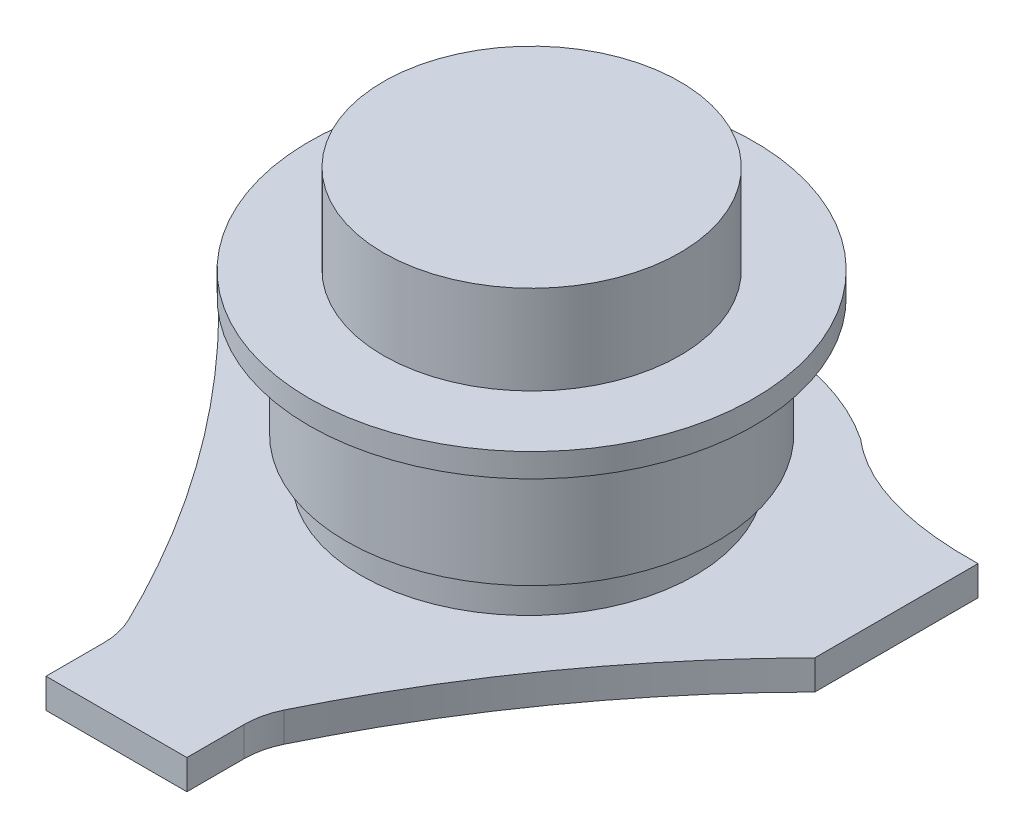
ISO-10303-21;
HEADER;
FILE_DESCRIPTION(('STEP AP214'),'2;1');
FILE_NAME('part.step','',(''),(''),'','','');
FILE_SCHEMA(('AUTOMOTIVE_DESIGN { 1 0 10303 214 1 1 1 1 }'));
ENDSEC;
DATA;
#1=APPLICATION_CONTEXT('core data for automotive mechanical design processes');
#2=APPLICATION_PROTOCOL_DEFINITION('international standard','automotive_design',2000,#1);
#3=PRODUCT_CONTEXT('',#1,'mechanical');
#4=PRODUCT('Part','Part','',(#3));
#5=PRODUCT_RELATED_PRODUCT_CATEGORY('part','',(#4));
#6=PRODUCT_DEFINITION_FORMATION('','',#4);
#7=PRODUCT_DEFINITION_CONTEXT('part definition',#1,'design');
#8=PRODUCT_DEFINITION('design','',#6,#7);
#9=PRODUCT_DEFINITION_SHAPE('','',#8);
#10=(LENGTH_UNIT() NAMED_UNIT(*) SI_UNIT(.MILLI.,.METRE.));
#11=(NAMED_UNIT(*) PLANE_ANGLE_UNIT() SI_UNIT($,.RADIAN.));
#12=(NAMED_UNIT(*) SI_UNIT($,.STERADIAN.) SOLID_ANGLE_UNIT());
#13=UNCERTAINTY_MEASURE_WITH_UNIT(LENGTH_MEASURE(1.E-05),#10,'distance_accuracy_value','');
#14=(GEOMETRIC_REPRESENTATION_CONTEXT(3) GLOBAL_UNCERTAINTY_ASSIGNED_CONTEXT((#13)) GLOBAL_UNIT_ASSIGNED_CONTEXT((#10,
#11,#12)) REPRESENTATION_CONTEXT('',''));
#15=CARTESIAN_POINT('',(0.,0.,0.));
#16=DIRECTION('',(0.,0.,1.));
#17=DIRECTION('',(1.,0.,0.));
#18=AXIS2_PLACEMENT_3D('',#15,#16,#17);
#19=CARTESIAN_POINT('',(-24.765,0.,61.294254306316));
#20=DIRECTION('',(0.,-1.,0.));
#21=DIRECTION('',(0.,0.,-1.));
#22=AXIS2_PLACEMENT_3D('',#19,#20,#21);
#23=CYLINDRICAL_SURFACE('',#22,12.7);
#24=DIRECTION('',(0.,-1.,0.));
#25=VECTOR('',#24,1.);
#26=CARTESIAN_POINT('',(-13.3430442549293,0.,55.7418740097543));
#27=LINE('',#26,#25);
#28=CARTESIAN_POINT('',(-13.3430442549293,0.,55.7418740097543));
#29=VERTEX_POINT('',#28);
#30=CARTESIAN_POINT('',(-13.3430442549293,5.08,55.7418740097543));
#31=VERTEX_POINT('',#30);
#32=EDGE_CURVE('E144',#29,#31,#27,.F.);
#33=ORIENTED_EDGE('',*,*,#32,.F.);
#34=CARTESIAN_POINT('',(-24.765,0.,61.294254306316));
#35=DIRECTION('',(0.,1.,0.));
#36=DIRECTION('',(0.,0.,1.));
#37=AXIS2_PLACEMENT_3D('',#34,#35,#36);
#38=CIRCLE('',#37,12.7);
#39=CARTESIAN_POINT('',(-12.065,0.,61.294254306316));
#40=VERTEX_POINT('',#39);
#41=EDGE_CURVE('E155',#29,#40,#38,.F.);
#42=ORIENTED_EDGE('',*,*,#41,.T.);
#43=DIRECTION('',(0.,1.,0.));
#44=VECTOR('',#43,1.);
#45=CARTESIAN_POINT('',(-12.065,0.,61.294254306316));
#46=LINE('',#45,#44);
#47=CARTESIAN_POINT('',(-12.065,5.08,61.294254306316));
#48=VERTEX_POINT('',#47);
#49=EDGE_CURVE('E147',#48,#40,#46,.F.);
#50=ORIENTED_EDGE('',*,*,#49,.F.);
#51=CARTESIAN_POINT('',(-24.765,5.08,61.294254306316));
#52=DIRECTION('',(0.,1.,0.));
#53=DIRECTION('',(0.,0.,1.));
#54=AXIS2_PLACEMENT_3D('',#51,#52,#53);
#55=CIRCLE('',#54,12.7);
#56=EDGE_CURVE('E157',#48,#31,#55,.T.);
#57=ORIENTED_EDGE('',*,*,#56,.T.);
#58=EDGE_LOOP('',(#33,#42,#50,#57));
#59=FACE_BOUND('',#58,.T.);
#60=ADVANCED_FACE('F33',(#59),#23,.F.);
#61=CARTESIAN_POINT('',(51.054,5.08,0.));
#62=DIRECTION('',(-1.,0.,0.));
#63=DIRECTION('',(0.,0.,1.));
#64=AXIS2_PLACEMENT_3D('',#61,#62,#63);
#65=PLANE('',#64);
#66=DIRECTION('',(0.,0.,-1.));
#67=VECTOR('',#66,1.);
#68=CARTESIAN_POINT('',(51.054,0.,0.));
#69=LINE('',#68,#67);
#70=CARTESIAN_POINT('',(51.054,0.,2.54));
#71=VERTEX_POINT('',#70);
#72=CARTESIAN_POINT('',(51.054,0.,-25.4));
#73=VERTEX_POINT('',#72);
#74=EDGE_CURVE('E143',#71,#73,#69,.T.);
#75=ORIENTED_EDGE('',*,*,#74,.T.);
#76=DIRECTION('',(0.,-1.,0.));
#77=VECTOR('',#76,1.);
#78=CARTESIAN_POINT('',(51.054,5.08,-25.4));
#79=LINE('',#78,#77);
#80=CARTESIAN_POINT('',(51.054,5.08,-25.4));
#81=VERTEX_POINT('',#80);
#82=EDGE_CURVE('E124',#81,#73,#79,.T.);
#83=ORIENTED_EDGE('',*,*,#82,.F.);
#84=DIRECTION('',(0.,0.,-1.));
#85=VECTOR('',#84,1.);
#86=CARTESIAN_POINT('',(51.054,5.08,0.));
#87=LINE('',#86,#85);
#88=CARTESIAN_POINT('',(51.054,5.08,2.54));
#89=VERTEX_POINT('',#88);
#90=EDGE_CURVE('E131',#89,#81,#87,.T.);
#91=ORIENTED_EDGE('',*,*,#90,.F.);
#92=DIRECTION('',(0.,-1.,0.));
#93=VECTOR('',#92,1.);
#94=CARTESIAN_POINT('',(51.054,5.08,2.54));
#95=LINE('',#94,#93);
#96=EDGE_CURVE('E177',#89,#71,#95,.T.);
#97=ORIENTED_EDGE('',*,*,#96,.T.);
#98=EDGE_LOOP('',(#75,#83,#91,#97));
#99=FACE_BOUND('',#98,.T.);
#100=ADVANCED_FACE('F141',(#99),#65,.F.);
#101=CARTESIAN_POINT('',(51.054,5.08,-25.4));
#102=CARTESIAN_POINT('',(32.8121018484096,5.08,-25.0303382975073));
#103=CARTESIAN_POINT('',(22.5628296294602,5.08,-33.8013064704895));
#104=B_SPLINE_CURVE_WITH_KNOTS('',2,(#101,#102,#103),.UNSPECIFIED.,.F.,.F.,(3,3),(0.,
0.488428602010986),.UNSPECIFIED.);
#105=DIRECTION('',(0.,-1.,0.));
#106=VECTOR('',#105,1.);
#107=SURFACE_OF_LINEAR_EXTRUSION('',#104,#106);
#108=CARTESIAN_POINT('',(51.054,0.,-25.4));
#109=CARTESIAN_POINT('',(32.8121018484096,0.,-25.0303382975073));
#110=CARTESIAN_POINT('',(22.5628296294602,0.,-33.8013064704895));
#111=B_SPLINE_CURVE_WITH_KNOTS('',2,(#108,#109,#110),.UNSPECIFIED.,.F.,.F.,(3,3),(0.,
0.488428602010986),.UNSPECIFIED.);
#112=CARTESIAN_POINT('',(22.5628296294601,0.,-33.8013064704895));
#113=VERTEX_POINT('',#112);
#114=EDGE_CURVE('E206',#73,#113,#111,.T.);
#115=ORIENTED_EDGE('',*,*,#114,.T.);
#116=DIRECTION('',(0.,-1.,0.));
#117=VECTOR('',#116,1.);
#118=CARTESIAN_POINT('',(22.5628296294601,5.08,-33.8013064704895));
#119=LINE('',#118,#117);
#120=CARTESIAN_POINT('',(22.5628296294601,5.08,-33.8013064704895));
#121=VERTEX_POINT('',#120);
#122=EDGE_CURVE('E127',#121,#113,#119,.T.);
#123=ORIENTED_EDGE('',*,*,#122,.F.);
#124=EDGE_CURVE('E120',#81,#121,#104,.T.);
#125=ORIENTED_EDGE('',*,*,#124,.F.);
#126=ORIENTED_EDGE('',*,*,#82,.T.);
#127=EDGE_LOOP('',(#115,#123,#125,#126));
#128=FACE_BOUND('',#127,.T.);
#129=ADVANCED_FACE('F122',(#128),#107,.F.);
#130=CARTESIAN_POINT('',(0.,5.08,0.));
#131=DIRECTION('',(0.,-1.,0.));
#132=DIRECTION('',(0.,0.,-1.));
#133=AXIS2_PLACEMENT_3D('',#130,#131,#132);
#134=CYLINDRICAL_SURFACE('',#133,40.64);
#135=CARTESIAN_POINT('',(0.,0.,0.));
#136=DIRECTION('',(0.,1.,0.));
#137=DIRECTION('',(0.,0.,1.));
#138=AXIS2_PLACEMENT_3D('',#135,#136,#137);
#139=CIRCLE('',#138,40.64);
#140=CARTESIAN_POINT('',(-22.5628296294601,0.,-33.8013064704895));
#141=VERTEX_POINT('',#140);
#142=EDGE_CURVE('E204',#113,#141,#139,.T.);
#143=ORIENTED_EDGE('',*,*,#142,.T.);
#144=DIRECTION('',(0.,-1.,0.));
#145=VECTOR('',#144,1.);
#146=CARTESIAN_POINT('',(-22.5628296294601,5.08,-33.8013064704895));
#147=LINE('',#146,#145);
#148=CARTESIAN_POINT('',(-22.5628296294601,5.08,-33.8013064704895));
#149=VERTEX_POINT('',#148);
#150=EDGE_CURVE('E149',#149,#141,#147,.T.);
#151=ORIENTED_EDGE('',*,*,#150,.F.);
#152=CARTESIAN_POINT('',(0.,5.08,0.));
#153=DIRECTION('',(0.,1.,0.));
#154=DIRECTION('',(0.,0.,1.));
#155=AXIS2_PLACEMENT_3D('',#152,#153,#154);
#156=CIRCLE('',#155,40.64);
#157=EDGE_CURVE('E130',#121,#149,#156,.T.);
#158=ORIENTED_EDGE('',*,*,#157,.F.);
#159=ORIENTED_EDGE('',*,*,#122,.T.);
#160=EDGE_LOOP('',(#143,#151,#158,#159));
#161=FACE_BOUND('',#160,.T.);
#162=ADVANCED_FACE('F205',(#161),#134,.T.);
#163=CARTESIAN_POINT('',(-51.054,5.08,-25.4));
#164=CARTESIAN_POINT('',(-32.8121018484096,5.08,-25.0303382975072));
#165=CARTESIAN_POINT('',(-22.5628296294602,5.08,-33.8013064704895));
#166=B_SPLINE_CURVE_WITH_KNOTS('',2,(#163,#164,#165),.UNSPECIFIED.,.F.,.F.,(3,3),(0.,
0.488428602010987),.UNSPECIFIED.);
#167=DIRECTION('',(0.,-1.,0.));
#168=VECTOR('',#167,1.);
#169=SURFACE_OF_LINEAR_EXTRUSION('',#166,#168);
#170=CARTESIAN_POINT('',(-51.054,0.,-25.4));
#171=CARTESIAN_POINT('',(-32.8121018484096,0.,-25.0303382975072));
#172=CARTESIAN_POINT('',(-22.5628296294602,0.,-33.8013064704895));
#173=B_SPLINE_CURVE_WITH_KNOTS('',2,(#170,#171,#172),.UNSPECIFIED.,.F.,.F.,(3,3),(0.,
0.488428602010987),.UNSPECIFIED.);
#174=CARTESIAN_POINT('',(-51.054,0.,-25.4));
#175=VERTEX_POINT('',#174);
#176=EDGE_CURVE('E198',#175,#141,#173,.T.);
#177=ORIENTED_EDGE('',*,*,#176,.F.);
#178=DIRECTION('',(0.,-1.,0.));
#179=VECTOR('',#178,1.);
#180=CARTESIAN_POINT('',(-51.054,5.08,-25.4));
#181=LINE('',#180,#179);
#182=CARTESIAN_POINT('',(-51.054,5.08,-25.4));
#183=VERTEX_POINT('',#182);
#184=EDGE_CURVE('E190',#183,#175,#181,.T.);
#185=ORIENTED_EDGE('',*,*,#184,.F.);
#186=EDGE_CURVE('E201',#183,#149,#166,.T.);
#187=ORIENTED_EDGE('',*,*,#186,.T.);
#188=ORIENTED_EDGE('',*,*,#150,.T.);
#189=EDGE_LOOP('',(#177,#185,#187,#188));
#190=FACE_BOUND('',#189,.T.);
#191=ADVANCED_FACE('F196',(#190),#169,.T.);
#192=CARTESIAN_POINT('',(-51.054,5.08,0.));
#193=DIRECTION('',(-1.,0.,0.));
#194=DIRECTION('',(0.,0.,1.));
#195=AXIS2_PLACEMENT_3D('',#192,#193,#194);
#196=PLANE('',#195);
#197=DIRECTION('',(0.,0.,-1.));
#198=VECTOR('',#197,1.);
#199=CARTESIAN_POINT('',(-51.054,0.,0.));
#200=LINE('',#199,#198);
#201=CARTESIAN_POINT('',(-51.054,0.,2.54));
#202=VERTEX_POINT('',#201);
#203=EDGE_CURVE('E210',#202,#175,#200,.T.);
#204=ORIENTED_EDGE('',*,*,#203,.F.);
#205=DIRECTION('',(0.,-1.,0.));
#206=VECTOR('',#205,1.);
#207=CARTESIAN_POINT('',(-51.054,5.08,2.54));
#208=LINE('',#207,#206);
#209=CARTESIAN_POINT('',(-51.054,5.08,2.54));
#210=VERTEX_POINT('',#209);
#211=EDGE_CURVE('E188',#210,#202,#208,.T.);
#212=ORIENTED_EDGE('',*,*,#211,.F.);
#213=DIRECTION('',(0.,0.,-1.));
#214=VECTOR('',#213,1.);
#215=CARTESIAN_POINT('',(-51.054,5.08,0.));
#216=LINE('',#215,#214);
#217=EDGE_CURVE('E252',#210,#183,#216,.T.);
#218=ORIENTED_EDGE('',*,*,#217,.T.);
#219=ORIENTED_EDGE('',*,*,#184,.T.);
#220=EDGE_LOOP('',(#204,#212,#218,#219));
#221=FACE_BOUND('',#220,.T.);
#222=ADVANCED_FACE('F248',(#221),#196,.T.);
#223=CARTESIAN_POINT('',(-51.054,5.08,2.54000000000001));
#224=CARTESIAN_POINT('',(-26.7459712344895,5.08,27.0771938263688));
#225=CARTESIAN_POINT('',(-12.065,5.08,58.42));
#226=B_SPLINE_CURVE_WITH_KNOTS('',2,(#223,#224,#225),.UNSPECIFIED.,.F.,.F.,(3,3),(0.,1.),.UNSPECIFIED.);
#227=DIRECTION('',(0.,-1.,0.));
#228=VECTOR('',#227,1.);
#229=SURFACE_OF_LINEAR_EXTRUSION('',#226,#228);
#230=CARTESIAN_POINT('',(-51.054,0.,2.54000000000001));
#231=CARTESIAN_POINT('',(-26.7459712344895,0.,27.0771938263688));
#232=CARTESIAN_POINT('',(-12.065,0.,58.42));
#233=B_SPLINE_CURVE_WITH_KNOTS('',2,(#230,#231,#232),.UNSPECIFIED.,.F.,.F.,(3,3),(0.,1.),.UNSPECIFIED.);
#234=EDGE_CURVE('E212',#202,#29,#233,.T.);
#235=ORIENTED_EDGE('',*,*,#234,.T.);
#236=ORIENTED_EDGE('',*,*,#32,.T.);
#237=EDGE_CURVE('E255',#210,#31,#226,.T.);
#238=ORIENTED_EDGE('',*,*,#237,.F.);
#239=ORIENTED_EDGE('',*,*,#211,.T.);
#240=EDGE_LOOP('',(#235,#236,#238,#239));
#241=FACE_BOUND('',#240,.T.);
#242=ADVANCED_FACE('F357',(#241),#229,.F.);
#243=CARTESIAN_POINT('',(-12.065,5.08,0.));
#244=DIRECTION('',(1.,0.,0.));
#245=DIRECTION('',(0.,0.,-1.));
#246=AXIS2_PLACEMENT_3D('',#243,#244,#245);
#247=PLANE('',#246);
#248=DIRECTION('',(0.,0.,1.));
#249=VECTOR('',#248,1.);
#250=CARTESIAN_POINT('',(-12.065,5.08,0.));
#251=LINE('',#250,#249);
#252=CARTESIAN_POINT('',(-12.065,5.08,71.12));
#253=VERTEX_POINT('',#252);
#254=EDGE_CURVE('E242',#48,#253,#251,.T.);
#255=ORIENTED_EDGE('',*,*,#254,.F.);
#256=ORIENTED_EDGE('',*,*,#49,.T.);
#257=DIRECTION('',(0.,0.,1.));
#258=VECTOR('',#257,1.);
#259=CARTESIAN_POINT('',(-12.065,0.,0.));
#260=LINE('',#259,#258);
#261=CARTESIAN_POINT('',(-12.065,0.,71.12));
#262=VERTEX_POINT('',#261);
#263=EDGE_CURVE('E225',#40,#262,#260,.T.);
#264=ORIENTED_EDGE('',*,*,#263,.T.);
#265=DIRECTION('',(0.,-1.,0.));
#266=VECTOR('',#265,1.);
#267=CARTESIAN_POINT('',(-12.065,5.08,71.12));
#268=LINE('',#267,#266);
#269=EDGE_CURVE('E185',#253,#262,#268,.T.);
#270=ORIENTED_EDGE('',*,*,#269,.F.);
#271=EDGE_LOOP('',(#255,#256,#264,#270));
#272=FACE_BOUND('',#271,.T.);
#273=ADVANCED_FACE('F241',(#272),#247,.F.);
#274=CARTESIAN_POINT('',(0.,5.08,71.12));
#275=DIRECTION('',(0.,0.,1.));
#276=DIRECTION('',(1.,0.,0.));
#277=AXIS2_PLACEMENT_3D('',#274,#275,#276);
#278=PLANE('',#277);
#279=DIRECTION('',(-1.,0.,0.));
#280=VECTOR('',#279,1.);
#281=CARTESIAN_POINT('',(0.,0.,71.12));
#282=LINE('',#281,#280);
#283=CARTESIAN_POINT('',(12.065,0.,71.12));
#284=VERTEX_POINT('',#283);
#285=EDGE_CURVE('E171',#284,#262,#282,.T.);
#286=ORIENTED_EDGE('',*,*,#285,.F.);
#287=DIRECTION('',(0.,-1.,0.));
#288=VECTOR('',#287,1.);
#289=CARTESIAN_POINT('',(12.065,5.08,71.12));
#290=LINE('',#289,#288);
#291=CARTESIAN_POINT('',(12.065,5.08,71.12));
#292=VERTEX_POINT('',#291);
#293=EDGE_CURVE('E182',#292,#284,#290,.T.);
#294=ORIENTED_EDGE('',*,*,#293,.F.);
#295=DIRECTION('',(-1.,0.,0.));
#296=VECTOR('',#295,1.);
#297=CARTESIAN_POINT('',(0.,5.08,71.12));
#298=LINE('',#297,#296);
#299=EDGE_CURVE('E238',#292,#253,#298,.T.);
#300=ORIENTED_EDGE('',*,*,#299,.T.);
#301=ORIENTED_EDGE('',*,*,#269,.T.);
#302=EDGE_LOOP('',(#286,#294,#300,#301));
#303=FACE_BOUND('',#302,.T.);
#304=ADVANCED_FACE('F234',(#303),#278,.T.);
#305=CARTESIAN_POINT('',(12.065,5.08,0.));
#306=DIRECTION('',(1.,0.,0.));
#307=DIRECTION('',(0.,0.,-1.));
#308=AXIS2_PLACEMENT_3D('',#305,#306,#307);
#309=PLANE('',#308);
#310=DIRECTION('',(0.,0.,1.));
#311=VECTOR('',#310,1.);
#312=CARTESIAN_POINT('',(12.065,0.,0.));
#313=LINE('',#312,#311);
#314=CARTESIAN_POINT('',(12.065,0.,61.294254306316));
#315=VERTEX_POINT('',#314);
#316=EDGE_CURVE('E169',#315,#284,#313,.T.);
#317=ORIENTED_EDGE('',*,*,#316,.F.);
#318=DIRECTION('',(0.,1.,0.));
#319=VECTOR('',#318,1.);
#320=CARTESIAN_POINT('',(12.065,5.08,61.294254306316));
#321=LINE('',#320,#319);
#322=CARTESIAN_POINT('',(12.065,5.08,61.294254306316));
#323=VERTEX_POINT('',#322);
#324=EDGE_CURVE('E48',#315,#323,#321,.T.);
#325=ORIENTED_EDGE('',*,*,#324,.T.);
#326=DIRECTION('',(0.,0.,1.));
#327=VECTOR('',#326,1.);
#328=CARTESIAN_POINT('',(12.065,5.08,0.));
#329=LINE('',#328,#327);
#330=EDGE_CURVE('E483',#323,#292,#329,.T.);
#331=ORIENTED_EDGE('',*,*,#330,.T.);
#332=ORIENTED_EDGE('',*,*,#293,.T.);
#333=EDGE_LOOP('',(#317,#325,#331,#332));
#334=FACE_BOUND('',#333,.T.);
#335=ADVANCED_FACE('F375',(#334),#309,.T.);
#336=CARTESIAN_POINT('',(51.054,5.08,2.53999999999999));
#337=CARTESIAN_POINT('',(26.7459712344895,5.08,27.0771938263687));
#338=CARTESIAN_POINT('',(12.065,5.08,58.42));
#339=B_SPLINE_CURVE_WITH_KNOTS('',2,(#336,#337,#338),.UNSPECIFIED.,.F.,.F.,(3,3),(0.,1.),.UNSPECIFIED.);
#340=DIRECTION('',(0.,-1.,0.));
#341=VECTOR('',#340,1.);
#342=SURFACE_OF_LINEAR_EXTRUSION('',#339,#341);
#343=CARTESIAN_POINT('',(13.3430442549293,5.08,55.7418740097543));
#344=VERTEX_POINT('',#343);
#345=EDGE_CURVE('E137',#89,#344,#339,.T.);
#346=ORIENTED_EDGE('',*,*,#345,.T.);
#347=DIRECTION('',(0.,-1.,0.));
#348=VECTOR('',#347,1.);
#349=CARTESIAN_POINT('',(13.3430442549293,5.08,55.7418740097543));
#350=LINE('',#349,#348);
#351=CARTESIAN_POINT('',(13.3430442549293,0.,55.7418740097543));
#352=VERTEX_POINT('',#351);
#353=EDGE_CURVE('E159',#344,#352,#350,.T.);
#354=ORIENTED_EDGE('',*,*,#353,.T.);
#355=CARTESIAN_POINT('',(51.054,0.,2.53999999999999));
#356=CARTESIAN_POINT('',(26.7459712344895,0.,27.0771938263687));
#357=CARTESIAN_POINT('',(12.065,0.,58.42));
#358=B_SPLINE_CURVE_WITH_KNOTS('',2,(#355,#356,#357),.UNSPECIFIED.,.F.,.F.,(3,3),(0.,1.),.UNSPECIFIED.);
#359=EDGE_CURVE('E139',#71,#352,#358,.T.);
#360=ORIENTED_EDGE('',*,*,#359,.F.);
#361=ORIENTED_EDGE('',*,*,#96,.F.);
#362=EDGE_LOOP('',(#346,#354,#360,#361));
#363=FACE_BOUND('',#362,.T.);
#364=ADVANCED_FACE('F165',(#363),#342,.T.);
#365=CARTESIAN_POINT('',(0.,5.08,0.));
#366=DIRECTION('',(0.,1.,0.));
#367=DIRECTION('',(0.,0.,1.));
#368=AXIS2_PLACEMENT_3D('',#365,#366,#367);
#369=PLANE('',#368);
#370=CARTESIAN_POINT('',(0.,5.08,0.635000000000045));
#371=DIRECTION('',(0.,1.,0.));
#372=DIRECTION('',(0.,0.,1.));
#373=AXIS2_PLACEMENT_3D('',#370,#371,#372);
#374=CIRCLE('',#373,28.575);
#375=CARTESIAN_POINT('',(0.,5.08,29.2100000000001));
#376=VERTEX_POINT('',#375);
#377=EDGE_CURVE('E281',#376,#376,#374,.T.);
#378=ORIENTED_EDGE('',*,*,#377,.F.);
#379=EDGE_LOOP('',(#378));
#380=FACE_BOUND('',#379,.T.);
#381=ORIENTED_EDGE('',*,*,#56,.F.);
#382=ORIENTED_EDGE('',*,*,#254,.T.);
#383=ORIENTED_EDGE('',*,*,#299,.F.);
#384=ORIENTED_EDGE('',*,*,#330,.F.);
#385=CARTESIAN_POINT('',(24.765,5.08,61.294254306316));
#386=DIRECTION('',(0.,1.,0.));
#387=DIRECTION('',(0.,0.,1.));
#388=AXIS2_PLACEMENT_3D('',#385,#386,#387);
#389=CIRCLE('',#388,12.7);
#390=EDGE_CURVE('E11',#323,#344,#389,.F.);
#391=ORIENTED_EDGE('',*,*,#390,.T.);
#392=ORIENTED_EDGE('',*,*,#345,.F.);
#393=ORIENTED_EDGE('',*,*,#90,.T.);
#394=ORIENTED_EDGE('',*,*,#124,.T.);
#395=ORIENTED_EDGE('',*,*,#157,.T.);
#396=ORIENTED_EDGE('',*,*,#186,.F.);
#397=ORIENTED_EDGE('',*,*,#217,.F.);
#398=ORIENTED_EDGE('',*,*,#237,.T.);
#399=EDGE_LOOP('',(#381,#382,#383,#384,#391,#392,#393,#394,#395,#396,#397,#398));
#400=FACE_BOUND('',#399,.T.);
#401=ADVANCED_FACE('F135',(#380,#400),#369,.T.);
#402=CARTESIAN_POINT('',(0.,0.,0.));
#403=DIRECTION('',(0.,1.,0.));
#404=DIRECTION('',(0.,0.,1.));
#405=AXIS2_PLACEMENT_3D('',#402,#403,#404);
#406=PLANE('',#405);
#407=ORIENTED_EDGE('',*,*,#74,.F.);
#408=ORIENTED_EDGE('',*,*,#359,.T.);
#409=CARTESIAN_POINT('',(24.765,0.,61.294254306316));
#410=DIRECTION('',(0.,1.,0.));
#411=DIRECTION('',(0.,0.,1.));
#412=AXIS2_PLACEMENT_3D('',#409,#410,#411);
#413=CIRCLE('',#412,12.7);
#414=EDGE_CURVE('E41',#352,#315,#413,.T.);
#415=ORIENTED_EDGE('',*,*,#414,.T.);
#416=ORIENTED_EDGE('',*,*,#316,.T.);
#417=ORIENTED_EDGE('',*,*,#285,.T.);
#418=ORIENTED_EDGE('',*,*,#263,.F.);
#419=ORIENTED_EDGE('',*,*,#41,.F.);
#420=ORIENTED_EDGE('',*,*,#234,.F.);
#421=ORIENTED_EDGE('',*,*,#203,.T.);
#422=ORIENTED_EDGE('',*,*,#176,.T.);
#423=ORIENTED_EDGE('',*,*,#142,.F.);
#424=ORIENTED_EDGE('',*,*,#114,.F.);
#425=EDGE_LOOP('',(#407,#408,#415,#416,#417,#418,#419,#420,#421,#422,#423,#424));
#426=FACE_BOUND('',#425,.T.);
#427=ADVANCED_FACE('F168',(#426),#406,.F.);
#428=CARTESIAN_POINT('',(24.765,2.54,61.294254306316));
#429=DIRECTION('',(0.,-1.,0.));
#430=DIRECTION('',(0.,0.,-1.));
#431=AXIS2_PLACEMENT_3D('',#428,#429,#430);
#432=CYLINDRICAL_SURFACE('',#431,12.7);
#433=ORIENTED_EDGE('',*,*,#390,.F.);
#434=ORIENTED_EDGE('',*,*,#324,.F.);
#435=ORIENTED_EDGE('',*,*,#414,.F.);
#436=ORIENTED_EDGE('',*,*,#353,.F.);
#437=EDGE_LOOP('',(#433,#434,#435,#436));
#438=FACE_BOUND('',#437,.T.);
#439=ADVANCED_FACE('F35',(#438),#432,.F.);
#440=CARTESIAN_POINT('',(0.,11.43,0.635000000000045));
#441=DIRECTION('',(0.,-1.,0.));
#442=DIRECTION('',(0.,0.,-1.));
#443=AXIS2_PLACEMENT_3D('',#440,#441,#442);
#444=CYLINDRICAL_SURFACE('',#443,28.575);
#445=CARTESIAN_POINT('',(0.,11.43,0.635000000000045));
#446=DIRECTION('',(0.,1.,0.));
#447=DIRECTION('',(0.,0.,1.));
#448=AXIS2_PLACEMENT_3D('',#445,#446,#447);
#449=CIRCLE('',#448,28.575);
#450=CARTESIAN_POINT('',(0.,11.43,29.2100000000001));
#451=VERTEX_POINT('',#450);
#452=EDGE_CURVE('E284',#451,#451,#449,.T.);
#453=ORIENTED_EDGE('',*,*,#452,.F.);
#454=EDGE_LOOP('',(#453));
#455=FACE_BOUND('',#454,.T.);
#456=ORIENTED_EDGE('',*,*,#377,.T.);
#457=EDGE_LOOP('',(#456));
#458=FACE_BOUND('',#457,.T.);
#459=ADVANCED_FACE('F409',(#455,#458),#444,.T.);
#460=CARTESIAN_POINT('',(0.,31.75,0.));
#461=DIRECTION('',(0.,-1.,0.));
#462=DIRECTION('',(0.,0.,-1.));
#463=AXIS2_PLACEMENT_3D('',#460,#461,#462);
#464=CYLINDRICAL_SURFACE('',#463,31.75);
#465=CARTESIAN_POINT('',(0.,31.75,0.));
#466=DIRECTION('',(0.,1.,0.));
#467=DIRECTION('',(0.,0.,1.));
#468=AXIS2_PLACEMENT_3D('',#465,#466,#467);
#469=CIRCLE('',#468,31.75);
#470=CARTESIAN_POINT('',(0.,31.75,31.75));
#471=VERTEX_POINT('',#470);
#472=EDGE_CURVE('E285',#471,#471,#469,.T.);
#473=ORIENTED_EDGE('',*,*,#472,.F.);
#474=EDGE_LOOP('',(#473));
#475=FACE_BOUND('',#474,.T.);
#476=CARTESIAN_POINT('',(0.,11.43,0.));
#477=DIRECTION('',(0.,1.,0.));
#478=DIRECTION('',(0.,0.,1.));
#479=AXIS2_PLACEMENT_3D('',#476,#477,#478);
#480=CIRCLE('',#479,31.75);
#481=CARTESIAN_POINT('',(0.,11.43,31.75));
#482=VERTEX_POINT('',#481);
#483=EDGE_CURVE('E288',#482,#482,#480,.T.);
#484=ORIENTED_EDGE('',*,*,#483,.T.);
#485=EDGE_LOOP('',(#484));
#486=FACE_BOUND('',#485,.T.);
#487=ADVANCED_FACE('F414',(#475,#486),#464,.T.);
#488=CARTESIAN_POINT('',(0.,11.43,0.));
#489=DIRECTION('',(0.,1.,0.));
#490=DIRECTION('',(0.,0.,1.));
#491=AXIS2_PLACEMENT_3D('',#488,#489,#490);
#492=PLANE('',#491);
#493=ORIENTED_EDGE('',*,*,#452,.T.);
#494=EDGE_LOOP('',(#493));
#495=FACE_BOUND('',#494,.T.);
#496=ORIENTED_EDGE('',*,*,#483,.F.);
#497=EDGE_LOOP('',(#496));
#498=FACE_BOUND('',#497,.T.);
#499=ADVANCED_FACE('F324',(#495,#498),#492,.F.);
#500=CARTESIAN_POINT('',(0.,35.814,0.));
#501=DIRECTION('',(0.,-1.,0.));
#502=DIRECTION('',(0.,0.,-1.));
#503=AXIS2_PLACEMENT_3D('',#500,#501,#502);
#504=CYLINDRICAL_SURFACE('',#503,38.1);
#505=CARTESIAN_POINT('',(0.,35.814,0.));
#506=DIRECTION('',(0.,1.,0.));
#507=DIRECTION('',(0.,0.,1.));
#508=AXIS2_PLACEMENT_3D('',#505,#506,#507);
#509=CIRCLE('',#508,38.1);
#510=CARTESIAN_POINT('',(0.,35.814,38.1));
#511=VERTEX_POINT('',#510);
#512=EDGE_CURVE('E291',#511,#511,#509,.T.);
#513=ORIENTED_EDGE('',*,*,#512,.F.);
#514=EDGE_LOOP('',(#513));
#515=FACE_BOUND('',#514,.T.);
#516=CARTESIAN_POINT('',(0.,31.75,0.));
#517=DIRECTION('',(0.,1.,0.));
#518=DIRECTION('',(0.,0.,1.));
#519=AXIS2_PLACEMENT_3D('',#516,#517,#518);
#520=CIRCLE('',#519,38.1);
#521=CARTESIAN_POINT('',(0.,31.75,38.1));
#522=VERTEX_POINT('',#521);
#523=EDGE_CURVE('E294',#522,#522,#520,.T.);
#524=ORIENTED_EDGE('',*,*,#523,.T.);
#525=EDGE_LOOP('',(#524));
#526=FACE_BOUND('',#525,.T.);
#527=ADVANCED_FACE('F318',(#515,#526),#504,.T.);
#528=CARTESIAN_POINT('',(0.,35.814,0.));
#529=DIRECTION('',(0.,1.,0.));
#530=DIRECTION('',(0.,0.,1.));
#531=AXIS2_PLACEMENT_3D('',#528,#529,#530);
#532=PLANE('',#531);
#533=CARTESIAN_POINT('',(0.,35.814,0.));
#534=DIRECTION('',(0.,1.,0.));
#535=DIRECTION('',(0.,0.,1.));
#536=AXIS2_PLACEMENT_3D('',#533,#534,#535);
#537=CIRCLE('',#536,25.4);
#538=CARTESIAN_POINT('',(0.,35.814,25.4));
#539=VERTEX_POINT('',#538);
#540=EDGE_CURVE('E300',#539,#539,#537,.T.);
#541=ORIENTED_EDGE('',*,*,#540,.F.);
#542=EDGE_LOOP('',(#541));
#543=FACE_BOUND('',#542,.T.);
#544=ORIENTED_EDGE('',*,*,#512,.T.);
#545=EDGE_LOOP('',(#544));
#546=FACE_BOUND('',#545,.T.);
#547=ADVANCED_FACE('F315',(#543,#546),#532,.T.);
#548=CARTESIAN_POINT('',(0.,31.75,0.));
#549=DIRECTION('',(0.,1.,0.));
#550=DIRECTION('',(0.,0.,1.));
#551=AXIS2_PLACEMENT_3D('',#548,#549,#550);
#552=PLANE('',#551);
#553=ORIENTED_EDGE('',*,*,#472,.T.);
#554=EDGE_LOOP('',(#553));
#555=FACE_BOUND('',#554,.T.);
#556=ORIENTED_EDGE('',*,*,#523,.F.);
#557=EDGE_LOOP('',(#556));
#558=FACE_BOUND('',#557,.T.);
#559=ADVANCED_FACE('F311',(#555,#558),#552,.F.);
#560=CARTESIAN_POINT('',(0.,51.054,0.));
#561=DIRECTION('',(0.,-1.,0.));
#562=DIRECTION('',(0.,0.,-1.));
#563=AXIS2_PLACEMENT_3D('',#560,#561,#562);
#564=CYLINDRICAL_SURFACE('',#563,25.4);
#565=CARTESIAN_POINT('',(0.,51.054,0.));
#566=DIRECTION('',(0.,1.,0.));
#567=DIRECTION('',(0.,0.,1.));
#568=AXIS2_PLACEMENT_3D('',#565,#566,#567);
#569=CIRCLE('',#568,25.4);
#570=CARTESIAN_POINT('',(0.,51.054,25.4));
#571=VERTEX_POINT('',#570);
#572=EDGE_CURVE('E297',#571,#571,#569,.T.);
#573=ORIENTED_EDGE('',*,*,#572,.F.);
#574=EDGE_LOOP('',(#573));
#575=FACE_BOUND('',#574,.T.);
#576=ORIENTED_EDGE('',*,*,#540,.T.);
#577=EDGE_LOOP('',(#576));
#578=FACE_BOUND('',#577,.T.);
#579=ADVANCED_FACE('F308',(#575,#578),#564,.T.);
#580=CARTESIAN_POINT('',(0.,51.054,0.));
#581=DIRECTION('',(0.,1.,0.));
#582=DIRECTION('',(0.,0.,1.));
#583=AXIS2_PLACEMENT_3D('',#580,#581,#582);
#584=PLANE('',#583);
#585=ORIENTED_EDGE('',*,*,#572,.T.);
#586=EDGE_LOOP('',(#585));
#587=FACE_BOUND('',#586,.T.);
#588=ADVANCED_FACE('F306',(#587),#584,.T.);
#589=CLOSED_SHELL('',(#60,#100,#129,#162,#191,#222,#242,#273,#304,#335,#364,#401,#427,#439,#459,
#487,#499,#527,#547,#559,#579,#588));
#590=MANIFOLD_SOLID_BREP('B2',#589);
#591=ADVANCED_BREP_SHAPE_REPRESENTATION('',(#18,#590),#14);
#592=SHAPE_DEFINITION_REPRESENTATION(#9,#591);
ENDSEC;
END-ISO-10303-21;
